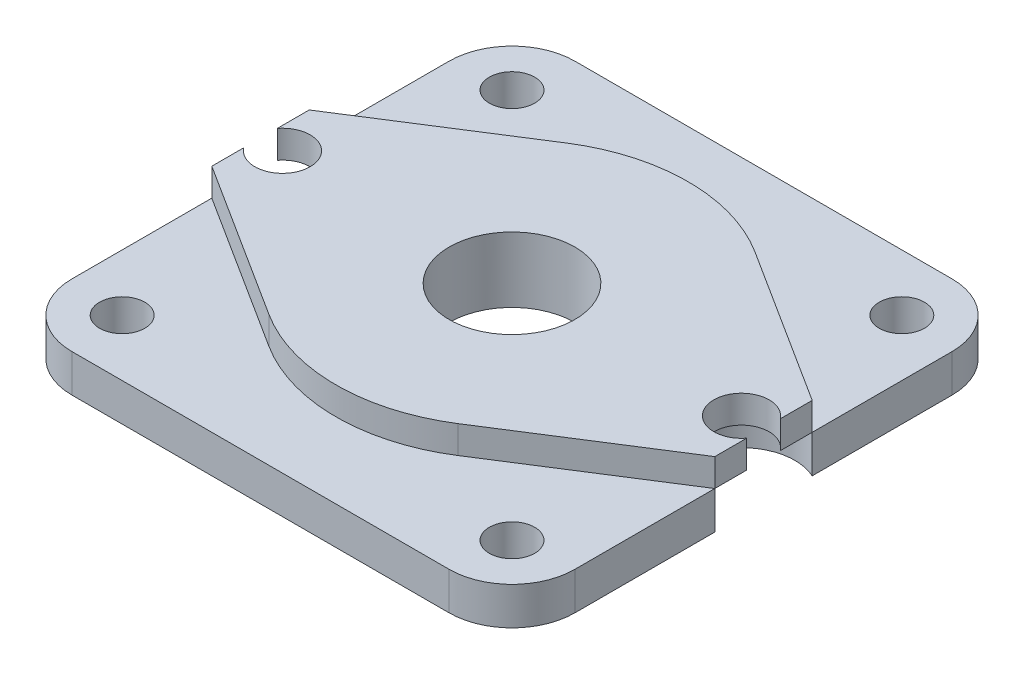
ISO-10303-21;
HEADER;
FILE_DESCRIPTION(('STEP AP214'),'2;1');
FILE_NAME('part.step','',(''),(''),'','','');
FILE_SCHEMA(('AUTOMOTIVE_DESIGN { 1 0 10303 214 1 1 1 1 }'));
ENDSEC;
DATA;
#1=APPLICATION_CONTEXT('core data for automotive mechanical design processes');
#2=APPLICATION_PROTOCOL_DEFINITION('international standard','automotive_design',2000,#1);
#3=PRODUCT_CONTEXT('',#1,'mechanical');
#4=PRODUCT('Part','Part','',(#3));
#5=PRODUCT_RELATED_PRODUCT_CATEGORY('part','',(#4));
#6=PRODUCT_DEFINITION_FORMATION('','',#4);
#7=PRODUCT_DEFINITION_CONTEXT('part definition',#1,'design');
#8=PRODUCT_DEFINITION('design','',#6,#7);
#9=PRODUCT_DEFINITION_SHAPE('','',#8);
#10=(LENGTH_UNIT() NAMED_UNIT(*) SI_UNIT(.MILLI.,.METRE.));
#11=(NAMED_UNIT(*) PLANE_ANGLE_UNIT() SI_UNIT($,.RADIAN.));
#12=(NAMED_UNIT(*) SI_UNIT($,.STERADIAN.) SOLID_ANGLE_UNIT());
#13=UNCERTAINTY_MEASURE_WITH_UNIT(LENGTH_MEASURE(1.E-05),#10,'distance_accuracy_value','');
#14=(GEOMETRIC_REPRESENTATION_CONTEXT(3) GLOBAL_UNCERTAINTY_ASSIGNED_CONTEXT((#13)) GLOBAL_UNIT_ASSIGNED_CONTEXT((#10,
#11,#12)) REPRESENTATION_CONTEXT('',''));
#15=CARTESIAN_POINT('',(0.,0.,0.));
#16=DIRECTION('',(0.,0.,1.));
#17=DIRECTION('',(1.,0.,0.));
#18=AXIS2_PLACEMENT_3D('',#15,#16,#17);
#19=CARTESIAN_POINT('',(-15.,3.,-15.));
#20=DIRECTION('',(0.,-1.,0.));
#21=DIRECTION('',(0.,0.,-1.));
#22=AXIS2_PLACEMENT_3D('',#19,#20,#21);
#23=PLANE('',#22);
#24=CARTESIAN_POINT('',(15.5,3.,15.5));
#25=DIRECTION('',(0.,1.,0.));
#26=DIRECTION('',(0.,0.,1.));
#27=AXIS2_PLACEMENT_3D('',#24,#25,#26);
#28=CIRCLE('',#27,1.79999999999999);
#29=CARTESIAN_POINT('',(15.5,3.,17.3));
#30=VERTEX_POINT('',#29);
#31=EDGE_CURVE('E217',#30,#30,#28,.T.);
#32=ORIENTED_EDGE('',*,*,#31,.F.);
#33=EDGE_LOOP('',(#32));
#34=FACE_BOUND('',#33,.T.);
#35=CARTESIAN_POINT('',(-15.5,3.,15.5));
#36=DIRECTION('',(0.,1.,0.));
#37=DIRECTION('',(0.,0.,1.));
#38=AXIS2_PLACEMENT_3D('',#35,#36,#37);
#39=CIRCLE('',#38,1.79999999999999);
#40=CARTESIAN_POINT('',(-15.5,3.,17.3));
#41=VERTEX_POINT('',#40);
#42=EDGE_CURVE('E223',#41,#41,#39,.T.);
#43=ORIENTED_EDGE('',*,*,#42,.F.);
#44=EDGE_LOOP('',(#43));
#45=FACE_BOUND('',#44,.T.);
#46=DIRECTION('',(0.843842743580431,0.,-0.536590555364751));
#47=VECTOR('',#46,1.);
#48=CARTESIAN_POINT('',(20.,3.,3.87298334620742));
#49=LINE('',#48,#47);
#50=CARTESIAN_POINT('',(7.51226777510651,3.,11.813798410126));
#51=VERTEX_POINT('',#50);
#52=CARTESIAN_POINT('',(20.,3.,3.87298334620742));
#53=VERTEX_POINT('',#52);
#54=EDGE_CURVE('E50',#51,#53,#49,.T.);
#55=ORIENTED_EDGE('',*,*,#54,.F.);
#56=CARTESIAN_POINT('',(0.,3.,0.));
#57=DIRECTION('',(0.,1.,0.));
#58=DIRECTION('',(0.,0.,1.));
#59=AXIS2_PLACEMENT_3D('',#56,#57,#58);
#60=CIRCLE('',#59,14.);
#61=CARTESIAN_POINT('',(-7.51226777510651,3.,11.813798410126));
#62=VERTEX_POINT('',#61);
#63=EDGE_CURVE('E54',#62,#51,#60,.T.);
#64=ORIENTED_EDGE('',*,*,#63,.F.);
#65=DIRECTION('',(0.843842743580431,0.,0.536590555364751));
#66=VECTOR('',#65,1.);
#67=CARTESIAN_POINT('',(-20.,3.,3.87298334620742));
#68=LINE('',#67,#66);
#69=CARTESIAN_POINT('',(-20.,3.,3.87298334620742));
#70=VERTEX_POINT('',#69);
#71=EDGE_CURVE('E347',#70,#62,#68,.T.);
#72=ORIENTED_EDGE('',*,*,#71,.F.);
#73=DIRECTION('',(0.,0.,1.));
#74=VECTOR('',#73,1.);
#75=CARTESIAN_POINT('',(-20.,3.,3.87298334620742));
#76=LINE('',#75,#74);
#77=CARTESIAN_POINT('',(-20.,3.,15.));
#78=VERTEX_POINT('',#77);
#79=EDGE_CURVE('E250',#70,#78,#76,.T.);
#80=ORIENTED_EDGE('',*,*,#79,.T.);
#81=CARTESIAN_POINT('',(-15.,3.,15.));
#82=DIRECTION('',(0.,1.,0.));
#83=DIRECTION('',(0.,0.,1.));
#84=AXIS2_PLACEMENT_3D('',#81,#82,#83);
#85=CIRCLE('',#84,5.);
#86=CARTESIAN_POINT('',(-15.,3.,20.));
#87=VERTEX_POINT('',#86);
#88=EDGE_CURVE('E252',#78,#87,#85,.T.);
#89=ORIENTED_EDGE('',*,*,#88,.T.);
#90=DIRECTION('',(1.,0.,0.));
#91=VECTOR('',#90,1.);
#92=CARTESIAN_POINT('',(-15.,3.,20.));
#93=LINE('',#92,#91);
#94=CARTESIAN_POINT('',(15.,3.,20.));
#95=VERTEX_POINT('',#94);
#96=EDGE_CURVE('E254',#87,#95,#93,.T.);
#97=ORIENTED_EDGE('',*,*,#96,.T.);
#98=CARTESIAN_POINT('',(15.,3.,15.));
#99=DIRECTION('',(0.,1.,0.));
#100=DIRECTION('',(0.,0.,1.));
#101=AXIS2_PLACEMENT_3D('',#98,#99,#100);
#102=CIRCLE('',#101,5.);
#103=CARTESIAN_POINT('',(20.,3.,15.));
#104=VERTEX_POINT('',#103);
#105=EDGE_CURVE('E256',#95,#104,#102,.T.);
#106=ORIENTED_EDGE('',*,*,#105,.T.);
#107=DIRECTION('',(0.,0.,-1.));
#108=VECTOR('',#107,1.);
#109=CARTESIAN_POINT('',(20.,3.,3.87298334620742));
#110=LINE('',#109,#108);
#111=EDGE_CURVE('E258',#104,#53,#110,.T.);
#112=ORIENTED_EDGE('',*,*,#111,.T.);
#113=EDGE_LOOP('',(#55,#64,#72,#80,#89,#97,#106,#112));
#114=FACE_BOUND('',#113,.T.);
#115=ADVANCED_FACE('F35',(#34,#45,#114),#23,.F.);
#116=CARTESIAN_POINT('',(15.5,3.,-15.5));
#117=DIRECTION('',(0.,1.,0.));
#118=DIRECTION('',(0.,0.,1.));
#119=AXIS2_PLACEMENT_3D('',#116,#117,#118);
#120=CIRCLE('',#119,1.8);
#121=CARTESIAN_POINT('',(15.5,3.,-13.7));
#122=VERTEX_POINT('',#121);
#123=EDGE_CURVE('E229',#122,#122,#120,.T.);
#124=ORIENTED_EDGE('',*,*,#123,.F.);
#125=EDGE_LOOP('',(#124));
#126=FACE_BOUND('',#125,.T.);
#127=CARTESIAN_POINT('',(-15.5,3.,-15.5));
#128=DIRECTION('',(0.,1.,0.));
#129=DIRECTION('',(0.,0.,1.));
#130=AXIS2_PLACEMENT_3D('',#127,#128,#129);
#131=CIRCLE('',#130,1.8);
#132=CARTESIAN_POINT('',(-15.5,3.,-13.7));
#133=VERTEX_POINT('',#132);
#134=EDGE_CURVE('E235',#133,#133,#131,.T.);
#135=ORIENTED_EDGE('',*,*,#134,.F.);
#136=EDGE_LOOP('',(#135));
#137=FACE_BOUND('',#136,.T.);
#138=DIRECTION('',(-0.843842743580431,0.,0.536590555364751));
#139=VECTOR('',#138,1.);
#140=CARTESIAN_POINT('',(-20.,3.,-3.87298334620742));
#141=LINE('',#140,#139);
#142=CARTESIAN_POINT('',(-7.51226777510651,3.,-11.813798410126));
#143=VERTEX_POINT('',#142);
#144=CARTESIAN_POINT('',(-20.,3.,-3.87298334620742));
#145=VERTEX_POINT('',#144);
#146=EDGE_CURVE('E405',#143,#145,#141,.T.);
#147=ORIENTED_EDGE('',*,*,#146,.F.);
#148=CARTESIAN_POINT('',(0.,3.,0.));
#149=DIRECTION('',(0.,1.,0.));
#150=DIRECTION('',(0.,0.,1.));
#151=AXIS2_PLACEMENT_3D('',#148,#149,#150);
#152=CIRCLE('',#151,14.);
#153=CARTESIAN_POINT('',(7.51226777510651,3.,-11.813798410126));
#154=VERTEX_POINT('',#153);
#155=EDGE_CURVE('E395',#154,#143,#152,.T.);
#156=ORIENTED_EDGE('',*,*,#155,.F.);
#157=DIRECTION('',(-0.843842743580431,0.,-0.536590555364751));
#158=VECTOR('',#157,1.);
#159=CARTESIAN_POINT('',(20.,3.,-3.87298334620742));
#160=LINE('',#159,#158);
#161=CARTESIAN_POINT('',(20.,3.,-3.87298334620742));
#162=VERTEX_POINT('',#161);
#163=EDGE_CURVE('E400',#162,#154,#160,.T.);
#164=ORIENTED_EDGE('',*,*,#163,.F.);
#165=DIRECTION('',(0.,0.,-1.));
#166=VECTOR('',#165,1.);
#167=CARTESIAN_POINT('',(20.,3.,-15.));
#168=LINE('',#167,#166);
#169=CARTESIAN_POINT('',(20.,3.,-15.));
#170=VERTEX_POINT('',#169);
#171=EDGE_CURVE('E263',#162,#170,#168,.T.);
#172=ORIENTED_EDGE('',*,*,#171,.T.);
#173=CARTESIAN_POINT('',(15.,3.,-15.));
#174=DIRECTION('',(0.,1.,0.));
#175=DIRECTION('',(0.,0.,1.));
#176=AXIS2_PLACEMENT_3D('',#173,#174,#175);
#177=CIRCLE('',#176,5.);
#178=CARTESIAN_POINT('',(15.,3.,-20.));
#179=VERTEX_POINT('',#178);
#180=EDGE_CURVE('E265',#170,#179,#177,.T.);
#181=ORIENTED_EDGE('',*,*,#180,.T.);
#182=DIRECTION('',(-1.,0.,0.));
#183=VECTOR('',#182,1.);
#184=CARTESIAN_POINT('',(-15.,3.,-20.));
#185=LINE('',#184,#183);
#186=CARTESIAN_POINT('',(-15.,3.,-20.));
#187=VERTEX_POINT('',#186);
#188=EDGE_CURVE('E267',#179,#187,#185,.T.);
#189=ORIENTED_EDGE('',*,*,#188,.T.);
#190=CARTESIAN_POINT('',(-15.,3.,-15.));
#191=DIRECTION('',(0.,1.,0.));
#192=DIRECTION('',(0.,0.,-1.));
#193=AXIS2_PLACEMENT_3D('',#190,#191,#192);
#194=CIRCLE('',#193,5.);
#195=CARTESIAN_POINT('',(-20.,3.,-15.));
#196=VERTEX_POINT('',#195);
#197=EDGE_CURVE('E241',#187,#196,#194,.T.);
#198=ORIENTED_EDGE('',*,*,#197,.T.);
#199=DIRECTION('',(0.,0.,1.));
#200=VECTOR('',#199,1.);
#201=CARTESIAN_POINT('',(-20.,3.,-15.));
#202=LINE('',#201,#200);
#203=EDGE_CURVE('E244',#196,#145,#202,.T.);
#204=ORIENTED_EDGE('',*,*,#203,.T.);
#205=EDGE_LOOP('',(#147,#156,#164,#172,#181,#189,#198,#204));
#206=FACE_BOUND('',#205,.T.);
#207=ADVANCED_FACE('F462',(#126,#137,#206),#23,.F.);
#208=CARTESIAN_POINT('',(-15.,0.,-15.));
#209=DIRECTION('',(0.,-1.,0.));
#210=DIRECTION('',(0.,0.,-1.));
#211=AXIS2_PLACEMENT_3D('',#208,#209,#210);
#212=PLANE('',#211);
#213=CARTESIAN_POINT('',(15.5,0.,15.5));
#214=DIRECTION('',(0.,1.,0.));
#215=DIRECTION('',(0.,0.,1.));
#216=AXIS2_PLACEMENT_3D('',#213,#214,#215);
#217=CIRCLE('',#216,1.79999999999999);
#218=CARTESIAN_POINT('',(15.5,0.,17.3));
#219=VERTEX_POINT('',#218);
#220=EDGE_CURVE('E211',#219,#219,#217,.T.);
#221=ORIENTED_EDGE('',*,*,#220,.T.);
#222=EDGE_LOOP('',(#221));
#223=FACE_BOUND('',#222,.T.);
#224=CARTESIAN_POINT('',(15.5,0.,-15.5));
#225=DIRECTION('',(0.,1.,0.));
#226=DIRECTION('',(0.,0.,1.));
#227=AXIS2_PLACEMENT_3D('',#224,#225,#226);
#228=CIRCLE('',#227,1.8);
#229=CARTESIAN_POINT('',(15.5,0.,-13.7));
#230=VERTEX_POINT('',#229);
#231=EDGE_CURVE('E226',#230,#230,#228,.T.);
#232=ORIENTED_EDGE('',*,*,#231,.T.);
#233=EDGE_LOOP('',(#232));
#234=FACE_BOUND('',#233,.T.);
#235=CARTESIAN_POINT('',(-15.,0.,-15.));
#236=DIRECTION('',(0.,1.,0.));
#237=DIRECTION('',(0.,0.,-1.));
#238=AXIS2_PLACEMENT_3D('',#235,#236,#237);
#239=CIRCLE('',#238,5.);
#240=CARTESIAN_POINT('',(-15.,0.,-20.));
#241=VERTEX_POINT('',#240);
#242=CARTESIAN_POINT('',(-20.,0.,-15.));
#243=VERTEX_POINT('',#242);
#244=EDGE_CURVE('E238',#241,#243,#239,.T.);
#245=ORIENTED_EDGE('',*,*,#244,.F.);
#246=DIRECTION('',(-1.,0.,0.));
#247=VECTOR('',#246,1.);
#248=CARTESIAN_POINT('',(-15.,0.,-20.));
#249=LINE('',#248,#247);
#250=CARTESIAN_POINT('',(15.,0.,-20.));
#251=VERTEX_POINT('',#250);
#252=EDGE_CURVE('E245',#251,#241,#249,.T.);
#253=ORIENTED_EDGE('',*,*,#252,.F.);
#254=CARTESIAN_POINT('',(15.,0.,-15.));
#255=DIRECTION('',(0.,1.,0.));
#256=DIRECTION('',(0.,0.,1.));
#257=AXIS2_PLACEMENT_3D('',#254,#255,#256);
#258=CIRCLE('',#257,5.);
#259=CARTESIAN_POINT('',(20.,0.,-15.));
#260=VERTEX_POINT('',#259);
#261=EDGE_CURVE('E290',#260,#251,#258,.T.);
#262=ORIENTED_EDGE('',*,*,#261,.F.);
#263=DIRECTION('',(0.,0.,-1.));
#264=VECTOR('',#263,1.);
#265=CARTESIAN_POINT('',(20.,0.,-15.));
#266=LINE('',#265,#264);
#267=CARTESIAN_POINT('',(20.,0.,-3.87298334620742));
#268=VERTEX_POINT('',#267);
#269=EDGE_CURVE('E288',#268,#260,#266,.T.);
#270=ORIENTED_EDGE('',*,*,#269,.F.);
#271=CARTESIAN_POINT('',(18.25,0.,0.));
#272=DIRECTION('',(0.,-1.,0.));
#273=DIRECTION('',(0.,0.,1.));
#274=AXIS2_PLACEMENT_3D('',#271,#272,#273);
#275=CIRCLE('',#274,4.25);
#276=CARTESIAN_POINT('',(20.,0.,3.87298334620742));
#277=VERTEX_POINT('',#276);
#278=EDGE_CURVE('E286',#277,#268,#275,.T.);
#279=ORIENTED_EDGE('',*,*,#278,.F.);
#280=DIRECTION('',(0.,0.,-1.));
#281=VECTOR('',#280,1.);
#282=CARTESIAN_POINT('',(20.,0.,3.87298334620742));
#283=LINE('',#282,#281);
#284=CARTESIAN_POINT('',(20.,0.,15.));
#285=VERTEX_POINT('',#284);
#286=EDGE_CURVE('E284',#285,#277,#283,.T.);
#287=ORIENTED_EDGE('',*,*,#286,.F.);
#288=CARTESIAN_POINT('',(15.,0.,15.));
#289=DIRECTION('',(0.,1.,0.));
#290=DIRECTION('',(0.,0.,1.));
#291=AXIS2_PLACEMENT_3D('',#288,#289,#290);
#292=CIRCLE('',#291,5.);
#293=CARTESIAN_POINT('',(15.,0.,20.));
#294=VERTEX_POINT('',#293);
#295=EDGE_CURVE('E282',#294,#285,#292,.T.);
#296=ORIENTED_EDGE('',*,*,#295,.F.);
#297=DIRECTION('',(1.,0.,0.));
#298=VECTOR('',#297,1.);
#299=CARTESIAN_POINT('',(-15.,0.,20.));
#300=LINE('',#299,#298);
#301=CARTESIAN_POINT('',(-15.,0.,20.));
#302=VERTEX_POINT('',#301);
#303=EDGE_CURVE('E280',#302,#294,#300,.T.);
#304=ORIENTED_EDGE('',*,*,#303,.F.);
#305=CARTESIAN_POINT('',(-15.,0.,15.));
#306=DIRECTION('',(0.,1.,0.));
#307=DIRECTION('',(0.,0.,1.));
#308=AXIS2_PLACEMENT_3D('',#305,#306,#307);
#309=CIRCLE('',#308,5.);
#310=CARTESIAN_POINT('',(-20.,0.,15.));
#311=VERTEX_POINT('',#310);
#312=EDGE_CURVE('E278',#311,#302,#309,.T.);
#313=ORIENTED_EDGE('',*,*,#312,.F.);
#314=DIRECTION('',(0.,0.,1.));
#315=VECTOR('',#314,1.);
#316=CARTESIAN_POINT('',(-20.,0.,3.87298334620742));
#317=LINE('',#316,#315);
#318=CARTESIAN_POINT('',(-20.,0.,3.87298334620742));
#319=VERTEX_POINT('',#318);
#320=EDGE_CURVE('E276',#319,#311,#317,.T.);
#321=ORIENTED_EDGE('',*,*,#320,.F.);
#322=CARTESIAN_POINT('',(-18.25,0.,0.));
#323=DIRECTION('',(0.,-1.,0.));
#324=DIRECTION('',(0.,0.,1.));
#325=AXIS2_PLACEMENT_3D('',#322,#323,#324);
#326=CIRCLE('',#325,4.25);
#327=CARTESIAN_POINT('',(-20.,0.,-3.87298334620742));
#328=VERTEX_POINT('',#327);
#329=EDGE_CURVE('E274',#328,#319,#326,.T.);
#330=ORIENTED_EDGE('',*,*,#329,.F.);
#331=DIRECTION('',(0.,0.,1.));
#332=VECTOR('',#331,1.);
#333=CARTESIAN_POINT('',(-20.,0.,-15.));
#334=LINE('',#333,#332);
#335=EDGE_CURVE('E272',#243,#328,#334,.T.);
#336=ORIENTED_EDGE('',*,*,#335,.F.);
#337=EDGE_LOOP('',(#245,#253,#262,#270,#279,#287,#296,#304,#313,#321,#330,#336));
#338=FACE_BOUND('',#337,.T.);
#339=CARTESIAN_POINT('',(-15.5,0.,-15.5));
#340=DIRECTION('',(0.,1.,0.));
#341=DIRECTION('',(0.,0.,1.));
#342=AXIS2_PLACEMENT_3D('',#339,#340,#341);
#343=CIRCLE('',#342,1.8);
#344=CARTESIAN_POINT('',(-15.5,0.,-13.7));
#345=VERTEX_POINT('',#344);
#346=EDGE_CURVE('E232',#345,#345,#343,.T.);
#347=ORIENTED_EDGE('',*,*,#346,.T.);
#348=EDGE_LOOP('',(#347));
#349=FACE_BOUND('',#348,.T.);
#350=CARTESIAN_POINT('',(-15.5,0.,15.5));
#351=DIRECTION('',(0.,1.,0.));
#352=DIRECTION('',(0.,0.,1.));
#353=AXIS2_PLACEMENT_3D('',#350,#351,#352);
#354=CIRCLE('',#353,1.79999999999999);
#355=CARTESIAN_POINT('',(-15.5,0.,17.3));
#356=VERTEX_POINT('',#355);
#357=EDGE_CURVE('E220',#356,#356,#354,.T.);
#358=ORIENTED_EDGE('',*,*,#357,.T.);
#359=EDGE_LOOP('',(#358));
#360=FACE_BOUND('',#359,.T.);
#361=CARTESIAN_POINT('',(0.,0.,0.));
#362=DIRECTION('',(0.,1.,0.));
#363=DIRECTION('',(0.,0.,1.));
#364=AXIS2_PLACEMENT_3D('',#361,#362,#363);
#365=CIRCLE('',#364,5.);
#366=CARTESIAN_POINT('',(0.,0.,5.));
#367=VERTEX_POINT('',#366);
#368=EDGE_CURVE('E208',#367,#367,#365,.T.);
#369=ORIENTED_EDGE('',*,*,#368,.T.);
#370=EDGE_LOOP('',(#369));
#371=FACE_BOUND('',#370,.T.);
#372=ADVANCED_FACE('F333',(#223,#234,#338,#349,#360,#371),#212,.T.);
#373=CARTESIAN_POINT('',(-15.,3.,-15.));
#374=DIRECTION('',(0.,-1.,0.));
#375=DIRECTION('',(0.,0.,-1.));
#376=AXIS2_PLACEMENT_3D('',#373,#374,#375);
#377=CYLINDRICAL_SURFACE('',#376,5.);
#378=ORIENTED_EDGE('',*,*,#244,.T.);
#379=DIRECTION('',(0.,-1.,0.));
#380=VECTOR('',#379,1.);
#381=CARTESIAN_POINT('',(-20.,3.,-15.));
#382=LINE('',#381,#380);
#383=EDGE_CURVE('E11',#196,#243,#382,.T.);
#384=ORIENTED_EDGE('',*,*,#383,.F.);
#385=ORIENTED_EDGE('',*,*,#197,.F.);
#386=DIRECTION('',(0.,-1.,0.));
#387=VECTOR('',#386,1.);
#388=CARTESIAN_POINT('',(-15.,3.,-20.));
#389=LINE('',#388,#387);
#390=EDGE_CURVE('E269',#187,#241,#389,.T.);
#391=ORIENTED_EDGE('',*,*,#390,.T.);
#392=EDGE_LOOP('',(#378,#384,#385,#391));
#393=FACE_BOUND('',#392,.T.);
#394=ADVANCED_FACE('F37',(#393),#377,.T.);
#395=CARTESIAN_POINT('',(-20.,3.,-15.));
#396=DIRECTION('',(1.,0.,0.));
#397=DIRECTION('',(0.,0.,-1.));
#398=AXIS2_PLACEMENT_3D('',#395,#396,#397);
#399=PLANE('',#398);
#400=ORIENTED_EDGE('',*,*,#335,.T.);
#401=DIRECTION('',(0.,-1.,0.));
#402=VECTOR('',#401,1.);
#403=CARTESIAN_POINT('',(-20.,3.,-3.87298334620742));
#404=LINE('',#403,#402);
#405=EDGE_CURVE('E43',#145,#328,#404,.T.);
#406=ORIENTED_EDGE('',*,*,#405,.F.);
#407=ORIENTED_EDGE('',*,*,#203,.F.);
#408=ORIENTED_EDGE('',*,*,#383,.T.);
#409=EDGE_LOOP('',(#400,#406,#407,#408));
#410=FACE_BOUND('',#409,.T.);
#411=ADVANCED_FACE('F465',(#410),#399,.F.);
#412=CARTESIAN_POINT('',(-18.25,3.,0.));
#413=DIRECTION('',(0.,-1.,0.));
#414=DIRECTION('',(0.,0.,-1.));
#415=AXIS2_PLACEMENT_3D('',#412,#413,#414);
#416=CYLINDRICAL_SURFACE('',#415,4.25);
#417=ORIENTED_EDGE('',*,*,#329,.T.);
#418=DIRECTION('',(0.,-1.,0.));
#419=VECTOR('',#418,1.);
#420=CARTESIAN_POINT('',(-20.,3.,3.87298334620742));
#421=LINE('',#420,#419);
#422=EDGE_CURVE('E319',#70,#319,#421,.T.);
#423=ORIENTED_EDGE('',*,*,#422,.F.);
#424=CARTESIAN_POINT('',(-18.25,3.,0.));
#425=DIRECTION('',(0.,-1.,0.));
#426=DIRECTION('',(0.,0.,1.));
#427=AXIS2_PLACEMENT_3D('',#424,#425,#426);
#428=CIRCLE('',#427,4.25);
#429=EDGE_CURVE('E247',#145,#70,#428,.T.);
#430=ORIENTED_EDGE('',*,*,#429,.F.);
#431=ORIENTED_EDGE('',*,*,#405,.T.);
#432=EDGE_LOOP('',(#417,#423,#430,#431));
#433=FACE_BOUND('',#432,.T.);
#434=ADVANCED_FACE('F326',(#433),#416,.F.);
#435=CARTESIAN_POINT('',(-20.,3.,3.87298334620742));
#436=DIRECTION('',(1.,0.,0.));
#437=DIRECTION('',(0.,0.,-1.));
#438=AXIS2_PLACEMENT_3D('',#435,#436,#437);
#439=PLANE('',#438);
#440=ORIENTED_EDGE('',*,*,#320,.T.);
#441=DIRECTION('',(0.,-1.,0.));
#442=VECTOR('',#441,1.);
#443=CARTESIAN_POINT('',(-20.,3.,15.));
#444=LINE('',#443,#442);
#445=EDGE_CURVE('E316',#78,#311,#444,.T.);
#446=ORIENTED_EDGE('',*,*,#445,.F.);
#447=ORIENTED_EDGE('',*,*,#79,.F.);
#448=ORIENTED_EDGE('',*,*,#422,.T.);
#449=EDGE_LOOP('',(#440,#446,#447,#448));
#450=FACE_BOUND('',#449,.T.);
#451=ADVANCED_FACE('F339',(#450),#439,.F.);
#452=CARTESIAN_POINT('',(-15.,3.,15.));
#453=DIRECTION('',(0.,-1.,0.));
#454=DIRECTION('',(0.,0.,-1.));
#455=AXIS2_PLACEMENT_3D('',#452,#453,#454);
#456=CYLINDRICAL_SURFACE('',#455,5.);
#457=ORIENTED_EDGE('',*,*,#312,.T.);
#458=DIRECTION('',(0.,-1.,0.));
#459=VECTOR('',#458,1.);
#460=CARTESIAN_POINT('',(-15.,3.,20.));
#461=LINE('',#460,#459);
#462=EDGE_CURVE('E313',#87,#302,#461,.T.);
#463=ORIENTED_EDGE('',*,*,#462,.F.);
#464=ORIENTED_EDGE('',*,*,#88,.F.);
#465=ORIENTED_EDGE('',*,*,#445,.T.);
#466=EDGE_LOOP('',(#457,#463,#464,#465));
#467=FACE_BOUND('',#466,.T.);
#468=ADVANCED_FACE('F343',(#467),#456,.T.);
#469=CARTESIAN_POINT('',(-15.,3.,20.));
#470=DIRECTION('',(0.,0.,-1.));
#471=DIRECTION('',(-1.,0.,0.));
#472=AXIS2_PLACEMENT_3D('',#469,#470,#471);
#473=PLANE('',#472);
#474=ORIENTED_EDGE('',*,*,#303,.T.);
#475=DIRECTION('',(0.,-1.,0.));
#476=VECTOR('',#475,1.);
#477=CARTESIAN_POINT('',(15.,3.,20.));
#478=LINE('',#477,#476);
#479=EDGE_CURVE('E310',#95,#294,#478,.T.);
#480=ORIENTED_EDGE('',*,*,#479,.F.);
#481=ORIENTED_EDGE('',*,*,#96,.F.);
#482=ORIENTED_EDGE('',*,*,#462,.T.);
#483=EDGE_LOOP('',(#474,#480,#481,#482));
#484=FACE_BOUND('',#483,.T.);
#485=ADVANCED_FACE('F497',(#484),#473,.F.);
#486=CARTESIAN_POINT('',(15.,3.,15.));
#487=DIRECTION('',(0.,-1.,0.));
#488=DIRECTION('',(0.,0.,-1.));
#489=AXIS2_PLACEMENT_3D('',#486,#487,#488);
#490=CYLINDRICAL_SURFACE('',#489,5.);
#491=ORIENTED_EDGE('',*,*,#295,.T.);
#492=DIRECTION('',(0.,-1.,0.));
#493=VECTOR('',#492,1.);
#494=CARTESIAN_POINT('',(20.,3.,15.));
#495=LINE('',#494,#493);
#496=EDGE_CURVE('E307',#104,#285,#495,.T.);
#497=ORIENTED_EDGE('',*,*,#496,.F.);
#498=ORIENTED_EDGE('',*,*,#105,.F.);
#499=ORIENTED_EDGE('',*,*,#479,.T.);
#500=EDGE_LOOP('',(#491,#497,#498,#499));
#501=FACE_BOUND('',#500,.T.);
#502=ADVANCED_FACE('F495',(#501),#490,.T.);
#503=CARTESIAN_POINT('',(20.,3.,3.87298334620742));
#504=DIRECTION('',(-1.,0.,0.));
#505=DIRECTION('',(0.,0.,1.));
#506=AXIS2_PLACEMENT_3D('',#503,#504,#505);
#507=PLANE('',#506);
#508=ORIENTED_EDGE('',*,*,#286,.T.);
#509=DIRECTION('',(0.,-1.,0.));
#510=VECTOR('',#509,1.);
#511=CARTESIAN_POINT('',(20.,3.,3.87298334620742));
#512=LINE('',#511,#510);
#513=EDGE_CURVE('E304',#53,#277,#512,.T.);
#514=ORIENTED_EDGE('',*,*,#513,.F.);
#515=ORIENTED_EDGE('',*,*,#111,.F.);
#516=ORIENTED_EDGE('',*,*,#496,.T.);
#517=EDGE_LOOP('',(#508,#514,#515,#516));
#518=FACE_BOUND('',#517,.T.);
#519=ADVANCED_FACE('F491',(#518),#507,.F.);
#520=CARTESIAN_POINT('',(18.25,3.,0.));
#521=DIRECTION('',(0.,-1.,0.));
#522=DIRECTION('',(0.,0.,-1.));
#523=AXIS2_PLACEMENT_3D('',#520,#521,#522);
#524=CYLINDRICAL_SURFACE('',#523,4.25);
#525=ORIENTED_EDGE('',*,*,#278,.T.);
#526=DIRECTION('',(0.,-1.,0.));
#527=VECTOR('',#526,1.);
#528=CARTESIAN_POINT('',(20.,3.,-3.87298334620742));
#529=LINE('',#528,#527);
#530=EDGE_CURVE('E301',#162,#268,#529,.T.);
#531=ORIENTED_EDGE('',*,*,#530,.F.);
#532=CARTESIAN_POINT('',(18.25,3.,0.));
#533=DIRECTION('',(0.,-1.,0.));
#534=DIRECTION('',(0.,0.,1.));
#535=AXIS2_PLACEMENT_3D('',#532,#533,#534);
#536=CIRCLE('',#535,4.25);
#537=EDGE_CURVE('E260',#53,#162,#536,.T.);
#538=ORIENTED_EDGE('',*,*,#537,.F.);
#539=ORIENTED_EDGE('',*,*,#513,.T.);
#540=EDGE_LOOP('',(#525,#531,#538,#539));
#541=FACE_BOUND('',#540,.T.);
#542=ADVANCED_FACE('F486',(#541),#524,.F.);
#543=CARTESIAN_POINT('',(20.,3.,-15.));
#544=DIRECTION('',(-1.,0.,0.));
#545=DIRECTION('',(0.,0.,1.));
#546=AXIS2_PLACEMENT_3D('',#543,#544,#545);
#547=PLANE('',#546);
#548=ORIENTED_EDGE('',*,*,#269,.T.);
#549=DIRECTION('',(0.,-1.,0.));
#550=VECTOR('',#549,1.);
#551=CARTESIAN_POINT('',(20.,3.,-15.));
#552=LINE('',#551,#550);
#553=EDGE_CURVE('E298',#170,#260,#552,.T.);
#554=ORIENTED_EDGE('',*,*,#553,.F.);
#555=ORIENTED_EDGE('',*,*,#171,.F.);
#556=ORIENTED_EDGE('',*,*,#530,.T.);
#557=EDGE_LOOP('',(#548,#554,#555,#556));
#558=FACE_BOUND('',#557,.T.);
#559=ADVANCED_FACE('F481',(#558),#547,.F.);
#560=CARTESIAN_POINT('',(15.,3.,-15.));
#561=DIRECTION('',(0.,-1.,0.));
#562=DIRECTION('',(0.,0.,-1.));
#563=AXIS2_PLACEMENT_3D('',#560,#561,#562);
#564=CYLINDRICAL_SURFACE('',#563,5.);
#565=ORIENTED_EDGE('',*,*,#261,.T.);
#566=DIRECTION('',(0.,-1.,0.));
#567=VECTOR('',#566,1.);
#568=CARTESIAN_POINT('',(15.,3.,-20.));
#569=LINE('',#568,#567);
#570=EDGE_CURVE('E295',#179,#251,#569,.T.);
#571=ORIENTED_EDGE('',*,*,#570,.F.);
#572=ORIENTED_EDGE('',*,*,#180,.F.);
#573=ORIENTED_EDGE('',*,*,#553,.T.);
#574=EDGE_LOOP('',(#565,#571,#572,#573));
#575=FACE_BOUND('',#574,.T.);
#576=ADVANCED_FACE('F477',(#575),#564,.T.);
#577=CARTESIAN_POINT('',(-15.,3.,-20.));
#578=DIRECTION('',(0.,0.,1.));
#579=DIRECTION('',(1.,0.,0.));
#580=AXIS2_PLACEMENT_3D('',#577,#578,#579);
#581=PLANE('',#580);
#582=ORIENTED_EDGE('',*,*,#252,.T.);
#583=ORIENTED_EDGE('',*,*,#390,.F.);
#584=ORIENTED_EDGE('',*,*,#188,.F.);
#585=ORIENTED_EDGE('',*,*,#570,.T.);
#586=EDGE_LOOP('',(#582,#583,#584,#585));
#587=FACE_BOUND('',#586,.T.);
#588=ADVANCED_FACE('F472',(#587),#581,.F.);
#589=CARTESIAN_POINT('',(-15.5,3.,-15.5));
#590=DIRECTION('',(0.,-1.,0.));
#591=DIRECTION('',(0.,0.,-1.));
#592=AXIS2_PLACEMENT_3D('',#589,#590,#591);
#593=CYLINDRICAL_SURFACE('',#592,1.8);
#594=ORIENTED_EDGE('',*,*,#134,.T.);
#595=EDGE_LOOP('',(#594));
#596=FACE_BOUND('',#595,.T.);
#597=ORIENTED_EDGE('',*,*,#346,.F.);
#598=EDGE_LOOP('',(#597));
#599=FACE_BOUND('',#598,.T.);
#600=ADVANCED_FACE('F517',(#596,#599),#593,.F.);
#601=CARTESIAN_POINT('',(15.5,3.,-15.5));
#602=DIRECTION('',(0.,-1.,0.));
#603=DIRECTION('',(0.,0.,-1.));
#604=AXIS2_PLACEMENT_3D('',#601,#602,#603);
#605=CYLINDRICAL_SURFACE('',#604,1.8);
#606=ORIENTED_EDGE('',*,*,#123,.T.);
#607=EDGE_LOOP('',(#606));
#608=FACE_BOUND('',#607,.T.);
#609=ORIENTED_EDGE('',*,*,#231,.F.);
#610=EDGE_LOOP('',(#609));
#611=FACE_BOUND('',#610,.T.);
#612=ADVANCED_FACE('F559',(#608,#611),#605,.F.);
#613=CARTESIAN_POINT('',(-15.5,3.,15.5));
#614=DIRECTION('',(0.,-1.,0.));
#615=DIRECTION('',(0.,0.,-1.));
#616=AXIS2_PLACEMENT_3D('',#613,#614,#615);
#617=CYLINDRICAL_SURFACE('',#616,1.79999999999999);
#618=ORIENTED_EDGE('',*,*,#42,.T.);
#619=EDGE_LOOP('',(#618));
#620=FACE_BOUND('',#619,.T.);
#621=ORIENTED_EDGE('',*,*,#357,.F.);
#622=EDGE_LOOP('',(#621));
#623=FACE_BOUND('',#622,.T.);
#624=ADVANCED_FACE('F566',(#620,#623),#617,.F.);
#625=CARTESIAN_POINT('',(15.5,3.,15.5));
#626=DIRECTION('',(0.,-1.,0.));
#627=DIRECTION('',(0.,0.,-1.));
#628=AXIS2_PLACEMENT_3D('',#625,#626,#627);
#629=CYLINDRICAL_SURFACE('',#628,1.79999999999999);
#630=ORIENTED_EDGE('',*,*,#31,.T.);
#631=EDGE_LOOP('',(#630));
#632=FACE_BOUND('',#631,.T.);
#633=ORIENTED_EDGE('',*,*,#220,.F.);
#634=EDGE_LOOP('',(#633));
#635=FACE_BOUND('',#634,.T.);
#636=ADVANCED_FACE('F573',(#632,#635),#629,.F.);
#637=CARTESIAN_POINT('',(0.,3.,0.));
#638=DIRECTION('',(0.,-1.,0.));
#639=DIRECTION('',(0.,0.,-1.));
#640=AXIS2_PLACEMENT_3D('',#637,#638,#639);
#641=CYLINDRICAL_SURFACE('',#640,5.);
#642=ORIENTED_EDGE('',*,*,#368,.F.);
#643=EDGE_LOOP('',(#642));
#644=FACE_BOUND('',#643,.T.);
#645=CARTESIAN_POINT('',(0.,5.2,0.));
#646=DIRECTION('',(0.,-1.,0.));
#647=DIRECTION('',(0.,0.,-1.));
#648=AXIS2_PLACEMENT_3D('',#645,#646,#647);
#649=CIRCLE('',#648,5.);
#650=CARTESIAN_POINT('',(0.,5.2,-5.));
#651=VERTEX_POINT('',#650);
#652=EDGE_CURVE('E438',#651,#651,#649,.T.);
#653=ORIENTED_EDGE('',*,*,#652,.F.);
#654=EDGE_LOOP('',(#653));
#655=FACE_BOUND('',#654,.T.);
#656=ADVANCED_FACE('F581',(#644,#655),#641,.F.);
#657=CARTESIAN_POINT('',(18.25,5.2,0.));
#658=DIRECTION('',(0.,1.,0.));
#659=DIRECTION('',(0.,0.,1.));
#660=AXIS2_PLACEMENT_3D('',#657,#658,#659);
#661=PLANE('',#660);
#662=ORIENTED_EDGE('',*,*,#652,.T.);
#663=EDGE_LOOP('',(#662));
#664=FACE_BOUND('',#663,.T.);
#665=CARTESIAN_POINT('',(18.25,5.2,0.));
#666=DIRECTION('',(0.,-1.,0.));
#667=DIRECTION('',(0.,0.,1.));
#668=AXIS2_PLACEMENT_3D('',#665,#666,#667);
#669=CIRCLE('',#668,2.2);
#670=CARTESIAN_POINT('',(20.,5.2,1.33322916259734));
#671=VERTEX_POINT('',#670);
#672=CARTESIAN_POINT('',(20.,5.2,-1.33322916259734));
#673=VERTEX_POINT('',#672);
#674=EDGE_CURVE('E194',#671,#673,#669,.T.);
#675=ORIENTED_EDGE('',*,*,#674,.T.);
#676=DIRECTION('',(0.,0.,-1.));
#677=VECTOR('',#676,1.);
#678=CARTESIAN_POINT('',(20.,5.2,-3.87298334620742));
#679=LINE('',#678,#677);
#680=CARTESIAN_POINT('',(20.,5.2,-3.87298334620742));
#681=VERTEX_POINT('',#680);
#682=EDGE_CURVE('E182',#673,#681,#679,.T.);
#683=ORIENTED_EDGE('',*,*,#682,.T.);
#684=DIRECTION('',(-0.843842743580431,0.,-0.536590555364751));
#685=VECTOR('',#684,1.);
#686=CARTESIAN_POINT('',(20.,5.2,-3.87298334620742));
#687=LINE('',#686,#685);
#688=CARTESIAN_POINT('',(7.51226777510651,5.2,-11.813798410126));
#689=VERTEX_POINT('',#688);
#690=EDGE_CURVE('E193',#681,#689,#687,.T.);
#691=ORIENTED_EDGE('',*,*,#690,.T.);
#692=CARTESIAN_POINT('',(0.,5.2,0.));
#693=DIRECTION('',(0.,1.,0.));
#694=DIRECTION('',(0.,0.,1.));
#695=AXIS2_PLACEMENT_3D('',#692,#693,#694);
#696=CIRCLE('',#695,14.);
#697=CARTESIAN_POINT('',(-7.51226777510651,5.2,-11.813798410126));
#698=VERTEX_POINT('',#697);
#699=EDGE_CURVE('E396',#689,#698,#696,.T.);
#700=ORIENTED_EDGE('',*,*,#699,.T.);
#701=DIRECTION('',(-0.843842743580431,0.,0.536590555364751));
#702=VECTOR('',#701,1.);
#703=CARTESIAN_POINT('',(-20.,5.2,-3.87298334620742));
#704=LINE('',#703,#702);
#705=CARTESIAN_POINT('',(-20.,5.2,-3.87298334620742));
#706=VERTEX_POINT('',#705);
#707=EDGE_CURVE('E446',#698,#706,#704,.T.);
#708=ORIENTED_EDGE('',*,*,#707,.T.);
#709=DIRECTION('',(0.,0.,1.));
#710=VECTOR('',#709,1.);
#711=CARTESIAN_POINT('',(-20.,5.2,-3.87298334620742));
#712=LINE('',#711,#710);
#713=CARTESIAN_POINT('',(-20.,5.2,-1.33322916259734));
#714=VERTEX_POINT('',#713);
#715=EDGE_CURVE('E448',#706,#714,#712,.T.);
#716=ORIENTED_EDGE('',*,*,#715,.T.);
#717=CARTESIAN_POINT('',(-18.25,5.2,0.));
#718=DIRECTION('',(0.,-1.,0.));
#719=DIRECTION('',(0.,0.,1.));
#720=AXIS2_PLACEMENT_3D('',#717,#718,#719);
#721=CIRCLE('',#720,2.2);
#722=CARTESIAN_POINT('',(-20.,5.2,1.33322916259734));
#723=VERTEX_POINT('',#722);
#724=EDGE_CURVE('E450',#714,#723,#721,.T.);
#725=ORIENTED_EDGE('',*,*,#724,.T.);
#726=DIRECTION('',(0.,0.,1.));
#727=VECTOR('',#726,1.);
#728=CARTESIAN_POINT('',(-20.,5.2,3.87298334620742));
#729=LINE('',#728,#727);
#730=CARTESIAN_POINT('',(-20.,5.2,3.87298334620742));
#731=VERTEX_POINT('',#730);
#732=EDGE_CURVE('E434',#723,#731,#729,.T.);
#733=ORIENTED_EDGE('',*,*,#732,.T.);
#734=DIRECTION('',(0.843842743580431,0.,0.536590555364751));
#735=VECTOR('',#734,1.);
#736=CARTESIAN_POINT('',(-20.,5.2,3.87298334620742));
#737=LINE('',#736,#735);
#738=CARTESIAN_POINT('',(-7.51226777510651,5.2,11.813798410126));
#739=VERTEX_POINT('',#738);
#740=EDGE_CURVE('E372',#731,#739,#737,.T.);
#741=ORIENTED_EDGE('',*,*,#740,.T.);
#742=CARTESIAN_POINT('',(0.,5.2,0.));
#743=DIRECTION('',(0.,1.,0.));
#744=DIRECTION('',(0.,0.,1.));
#745=AXIS2_PLACEMENT_3D('',#742,#743,#744);
#746=CIRCLE('',#745,14.);
#747=CARTESIAN_POINT('',(7.51226777510651,5.2,11.813798410126));
#748=VERTEX_POINT('',#747);
#749=EDGE_CURVE('E431',#739,#748,#746,.T.);
#750=ORIENTED_EDGE('',*,*,#749,.T.);
#751=DIRECTION('',(0.843842743580431,0.,-0.536590555364751));
#752=VECTOR('',#751,1.);
#753=CARTESIAN_POINT('',(20.,5.2,3.87298334620742));
#754=LINE('',#753,#752);
#755=CARTESIAN_POINT('',(20.,5.2,3.87298334620742));
#756=VERTEX_POINT('',#755);
#757=EDGE_CURVE('E427',#748,#756,#754,.T.);
#758=ORIENTED_EDGE('',*,*,#757,.T.);
#759=DIRECTION('',(0.,0.,-1.));
#760=VECTOR('',#759,1.);
#761=CARTESIAN_POINT('',(20.,5.2,1.33322916259734));
#762=LINE('',#761,#760);
#763=EDGE_CURVE('E199',#756,#671,#762,.T.);
#764=ORIENTED_EDGE('',*,*,#763,.T.);
#765=EDGE_LOOP('',(#675,#683,#691,#700,#708,#716,#725,#733,#741,#750,#758,#764));
#766=FACE_BOUND('',#765,.T.);
#767=ADVANCED_FACE('F197',(#664,#766),#661,.T.);
#768=CARTESIAN_POINT('',(20.,5.2,1.33322916259734));
#769=DIRECTION('',(-1.,0.,0.));
#770=DIRECTION('',(0.,0.,1.));
#771=AXIS2_PLACEMENT_3D('',#768,#769,#770);
#772=PLANE('',#771);
#773=DIRECTION('',(0.,0.,-1.));
#774=VECTOR('',#773,1.);
#775=CARTESIAN_POINT('',(20.,3.,1.33322916259734));
#776=LINE('',#775,#774);
#777=CARTESIAN_POINT('',(20.,3.,1.33322916259734));
#778=VERTEX_POINT('',#777);
#779=EDGE_CURVE('E203',#53,#778,#776,.T.);
#780=ORIENTED_EDGE('',*,*,#779,.T.);
#781=DIRECTION('',(0.,-1.,0.));
#782=VECTOR('',#781,1.);
#783=CARTESIAN_POINT('',(20.,5.2,1.33322916259734));
#784=LINE('',#783,#782);
#785=EDGE_CURVE('E417',#671,#778,#784,.T.);
#786=ORIENTED_EDGE('',*,*,#785,.F.);
#787=ORIENTED_EDGE('',*,*,#763,.F.);
#788=DIRECTION('',(0.,-1.,0.));
#789=VECTOR('',#788,1.);
#790=CARTESIAN_POINT('',(20.,5.2,3.87298334620742));
#791=LINE('',#790,#789);
#792=EDGE_CURVE('E419',#756,#53,#791,.T.);
#793=ORIENTED_EDGE('',*,*,#792,.T.);
#794=EDGE_LOOP('',(#780,#786,#787,#793));
#795=FACE_BOUND('',#794,.T.);
#796=ADVANCED_FACE('F597',(#795),#772,.F.);
#797=CARTESIAN_POINT('',(20.,5.2,3.87298334620742));
#798=DIRECTION('',(-0.536590555364751,0.,-0.843842743580431));
#799=DIRECTION('',(-0.843842743580431,0.,0.536590555364751));
#800=AXIS2_PLACEMENT_3D('',#797,#798,#799);
#801=PLANE('',#800);
#802=ORIENTED_EDGE('',*,*,#54,.T.);
#803=ORIENTED_EDGE('',*,*,#792,.F.);
#804=ORIENTED_EDGE('',*,*,#757,.F.);
#805=DIRECTION('',(0.,-1.,0.));
#806=VECTOR('',#805,1.);
#807=CARTESIAN_POINT('',(7.51226777510651,5.2,11.813798410126));
#808=LINE('',#807,#806);
#809=EDGE_CURVE('E377',#748,#51,#808,.T.);
#810=ORIENTED_EDGE('',*,*,#809,.T.);
#811=EDGE_LOOP('',(#802,#803,#804,#810));
#812=FACE_BOUND('',#811,.T.);
#813=ADVANCED_FACE('F425',(#812),#801,.F.);
#814=CARTESIAN_POINT('',(0.,5.2,0.));
#815=DIRECTION('',(0.,-1.,0.));
#816=DIRECTION('',(0.,0.,-1.));
#817=AXIS2_PLACEMENT_3D('',#814,#815,#816);
#818=CYLINDRICAL_SURFACE('',#817,14.);
#819=ORIENTED_EDGE('',*,*,#63,.T.);
#820=ORIENTED_EDGE('',*,*,#809,.F.);
#821=ORIENTED_EDGE('',*,*,#749,.F.);
#822=DIRECTION('',(0.,-1.,0.));
#823=VECTOR('',#822,1.);
#824=CARTESIAN_POINT('',(-7.51226777510651,5.2,11.813798410126));
#825=LINE('',#824,#823);
#826=EDGE_CURVE('E373',#739,#62,#825,.T.);
#827=ORIENTED_EDGE('',*,*,#826,.T.);
#828=EDGE_LOOP('',(#819,#820,#821,#827));
#829=FACE_BOUND('',#828,.T.);
#830=ADVANCED_FACE('F430',(#829),#818,.T.);
#831=CARTESIAN_POINT('',(-20.,5.2,3.87298334620742));
#832=DIRECTION('',(0.536590555364751,0.,-0.843842743580431));
#833=DIRECTION('',(-0.843842743580431,0.,-0.536590555364751));
#834=AXIS2_PLACEMENT_3D('',#831,#832,#833);
#835=PLANE('',#834);
#836=ORIENTED_EDGE('',*,*,#71,.T.);
#837=ORIENTED_EDGE('',*,*,#826,.F.);
#838=ORIENTED_EDGE('',*,*,#740,.F.);
#839=DIRECTION('',(0.,-1.,0.));
#840=VECTOR('',#839,1.);
#841=CARTESIAN_POINT('',(-20.,5.2,3.87298334620742));
#842=LINE('',#841,#840);
#843=EDGE_CURVE('E362',#731,#70,#842,.T.);
#844=ORIENTED_EDGE('',*,*,#843,.T.);
#845=EDGE_LOOP('',(#836,#837,#838,#844));
#846=FACE_BOUND('',#845,.T.);
#847=ADVANCED_FACE('F369',(#846),#835,.F.);
#848=CARTESIAN_POINT('',(-20.,5.2,3.87298334620742));
#849=DIRECTION('',(1.,0.,0.));
#850=DIRECTION('',(0.,0.,-1.));
#851=AXIS2_PLACEMENT_3D('',#848,#849,#850);
#852=PLANE('',#851);
#853=DIRECTION('',(0.,0.,1.));
#854=VECTOR('',#853,1.);
#855=CARTESIAN_POINT('',(-20.,3.,3.87298334620742));
#856=LINE('',#855,#854);
#857=CARTESIAN_POINT('',(-20.,3.,1.33322916259734));
#858=VERTEX_POINT('',#857);
#859=EDGE_CURVE('E354',#858,#70,#856,.T.);
#860=ORIENTED_EDGE('',*,*,#859,.T.);
#861=ORIENTED_EDGE('',*,*,#843,.F.);
#862=ORIENTED_EDGE('',*,*,#732,.F.);
#863=DIRECTION('',(0.,-1.,0.));
#864=VECTOR('',#863,1.);
#865=CARTESIAN_POINT('',(-20.,5.2,1.33322916259734));
#866=LINE('',#865,#864);
#867=EDGE_CURVE('E365',#723,#858,#866,.T.);
#868=ORIENTED_EDGE('',*,*,#867,.T.);
#869=EDGE_LOOP('',(#860,#861,#862,#868));
#870=FACE_BOUND('',#869,.T.);
#871=ADVANCED_FACE('F360',(#870),#852,.F.);
#872=CARTESIAN_POINT('',(-18.25,5.2,0.));
#873=DIRECTION('',(0.,-1.,0.));
#874=DIRECTION('',(0.,0.,-1.));
#875=AXIS2_PLACEMENT_3D('',#872,#873,#874);
#876=CYLINDRICAL_SURFACE('',#875,2.2);
#877=CARTESIAN_POINT('',(-18.25,3.,0.));
#878=DIRECTION('',(0.,-1.,0.));
#879=DIRECTION('',(0.,0.,1.));
#880=AXIS2_PLACEMENT_3D('',#877,#878,#879);
#881=CIRCLE('',#880,2.2);
#882=CARTESIAN_POINT('',(-20.,3.,-1.33322916259734));
#883=VERTEX_POINT('',#882);
#884=EDGE_CURVE('E366',#883,#858,#881,.T.);
#885=ORIENTED_EDGE('',*,*,#884,.T.);
#886=ORIENTED_EDGE('',*,*,#867,.F.);
#887=ORIENTED_EDGE('',*,*,#724,.F.);
#888=DIRECTION('',(0.,-1.,0.));
#889=VECTOR('',#888,1.);
#890=CARTESIAN_POINT('',(-20.,5.2,-1.33322916259734));
#891=LINE('',#890,#889);
#892=EDGE_CURVE('E375',#714,#883,#891,.T.);
#893=ORIENTED_EDGE('',*,*,#892,.T.);
#894=EDGE_LOOP('',(#885,#886,#887,#893));
#895=FACE_BOUND('',#894,.T.);
#896=ADVANCED_FACE('F455',(#895),#876,.F.);
#897=CARTESIAN_POINT('',(-20.,5.2,-3.87298334620742));
#898=DIRECTION('',(1.,0.,0.));
#899=DIRECTION('',(0.,0.,-1.));
#900=AXIS2_PLACEMENT_3D('',#897,#898,#899);
#901=PLANE('',#900);
#902=DIRECTION('',(0.,0.,1.));
#903=VECTOR('',#902,1.);
#904=CARTESIAN_POINT('',(-20.,3.,-3.87298334620742));
#905=LINE('',#904,#903);
#906=EDGE_CURVE('E355',#145,#883,#905,.T.);
#907=ORIENTED_EDGE('',*,*,#906,.T.);
#908=ORIENTED_EDGE('',*,*,#892,.F.);
#909=ORIENTED_EDGE('',*,*,#715,.F.);
#910=DIRECTION('',(0.,-1.,0.));
#911=VECTOR('',#910,1.);
#912=CARTESIAN_POINT('',(-20.,5.2,-3.87298334620742));
#913=LINE('',#912,#911);
#914=EDGE_CURVE('E383',#706,#145,#913,.T.);
#915=ORIENTED_EDGE('',*,*,#914,.T.);
#916=EDGE_LOOP('',(#907,#908,#909,#915));
#917=FACE_BOUND('',#916,.T.);
#918=ADVANCED_FACE('F457',(#917),#901,.F.);
#919=CARTESIAN_POINT('',(-20.,5.2,-3.87298334620742));
#920=DIRECTION('',(0.536590555364751,0.,0.843842743580431));
#921=DIRECTION('',(0.843842743580431,0.,-0.536590555364751));
#922=AXIS2_PLACEMENT_3D('',#919,#920,#921);
#923=PLANE('',#922);
#924=ORIENTED_EDGE('',*,*,#146,.T.);
#925=ORIENTED_EDGE('',*,*,#914,.F.);
#926=ORIENTED_EDGE('',*,*,#707,.F.);
#927=DIRECTION('',(0.,-1.,0.));
#928=VECTOR('',#927,1.);
#929=CARTESIAN_POINT('',(-7.51226777510651,5.2,-11.813798410126));
#930=LINE('',#929,#928);
#931=EDGE_CURVE('E386',#698,#143,#930,.T.);
#932=ORIENTED_EDGE('',*,*,#931,.T.);
#933=EDGE_LOOP('',(#924,#925,#926,#932));
#934=FACE_BOUND('',#933,.T.);
#935=ADVANCED_FACE('F461',(#934),#923,.F.);
#936=CARTESIAN_POINT('',(0.,5.2,0.));
#937=DIRECTION('',(0.,-1.,0.));
#938=DIRECTION('',(0.,0.,-1.));
#939=AXIS2_PLACEMENT_3D('',#936,#937,#938);
#940=CYLINDRICAL_SURFACE('',#939,14.);
#941=ORIENTED_EDGE('',*,*,#155,.T.);
#942=ORIENTED_EDGE('',*,*,#931,.F.);
#943=ORIENTED_EDGE('',*,*,#699,.F.);
#944=DIRECTION('',(0.,-1.,0.));
#945=VECTOR('',#944,1.);
#946=CARTESIAN_POINT('',(7.51226777510651,5.2,-11.813798410126));
#947=LINE('',#946,#945);
#948=EDGE_CURVE('E213',#689,#154,#947,.T.);
#949=ORIENTED_EDGE('',*,*,#948,.T.);
#950=EDGE_LOOP('',(#941,#942,#943,#949));
#951=FACE_BOUND('',#950,.T.);
#952=ADVANCED_FACE('F393',(#951),#940,.T.);
#953=CARTESIAN_POINT('',(20.,5.2,-3.87298334620742));
#954=DIRECTION('',(-0.536590555364751,0.,0.843842743580431));
#955=DIRECTION('',(0.843842743580431,0.,0.536590555364751));
#956=AXIS2_PLACEMENT_3D('',#953,#954,#955);
#957=PLANE('',#956);
#958=ORIENTED_EDGE('',*,*,#163,.T.);
#959=ORIENTED_EDGE('',*,*,#948,.F.);
#960=ORIENTED_EDGE('',*,*,#690,.F.);
#961=DIRECTION('',(0.,-1.,0.));
#962=VECTOR('',#961,1.);
#963=CARTESIAN_POINT('',(20.,5.2,-3.87298334620742));
#964=LINE('',#963,#962);
#965=EDGE_CURVE('E190',#681,#162,#964,.T.);
#966=ORIENTED_EDGE('',*,*,#965,.T.);
#967=EDGE_LOOP('',(#958,#959,#960,#966));
#968=FACE_BOUND('',#967,.T.);
#969=ADVANCED_FACE('F399',(#968),#957,.F.);
#970=CARTESIAN_POINT('',(20.,5.2,-3.87298334620742));
#971=DIRECTION('',(-1.,0.,0.));
#972=DIRECTION('',(0.,0.,1.));
#973=AXIS2_PLACEMENT_3D('',#970,#971,#972);
#974=PLANE('',#973);
#975=DIRECTION('',(0.,0.,-1.));
#976=VECTOR('',#975,1.);
#977=CARTESIAN_POINT('',(20.,3.,-3.87298334620742));
#978=LINE('',#977,#976);
#979=CARTESIAN_POINT('',(20.,3.,-1.33322916259734));
#980=VERTEX_POINT('',#979);
#981=EDGE_CURVE('E403',#980,#162,#978,.T.);
#982=ORIENTED_EDGE('',*,*,#981,.T.);
#983=ORIENTED_EDGE('',*,*,#965,.F.);
#984=ORIENTED_EDGE('',*,*,#682,.F.);
#985=DIRECTION('',(0.,-1.,0.));
#986=VECTOR('',#985,1.);
#987=CARTESIAN_POINT('',(20.,5.2,-1.33322916259734));
#988=LINE('',#987,#986);
#989=EDGE_CURVE('E187',#673,#980,#988,.T.);
#990=ORIENTED_EDGE('',*,*,#989,.T.);
#991=EDGE_LOOP('',(#982,#983,#984,#990));
#992=FACE_BOUND('',#991,.T.);
#993=ADVANCED_FACE('F185',(#992),#974,.F.);
#994=CARTESIAN_POINT('',(18.25,5.2,0.));
#995=DIRECTION('',(0.,-1.,0.));
#996=DIRECTION('',(0.,0.,-1.));
#997=AXIS2_PLACEMENT_3D('',#994,#995,#996);
#998=CYLINDRICAL_SURFACE('',#997,2.2);
#999=CARTESIAN_POINT('',(18.25,3.,0.));
#1000=DIRECTION('',(0.,-1.,0.));
#1001=DIRECTION('',(0.,0.,1.));
#1002=AXIS2_PLACEMENT_3D('',#999,#1000,#1001);
#1003=CIRCLE('',#1002,2.2);
#1004=EDGE_CURVE('E207',#778,#980,#1003,.T.);
#1005=ORIENTED_EDGE('',*,*,#1004,.T.);
#1006=ORIENTED_EDGE('',*,*,#989,.F.);
#1007=ORIENTED_EDGE('',*,*,#674,.F.);
#1008=ORIENTED_EDGE('',*,*,#785,.T.);
#1009=EDGE_LOOP('',(#1005,#1006,#1007,#1008));
#1010=FACE_BOUND('',#1009,.T.);
#1011=ADVANCED_FACE('F205',(#1010),#998,.F.);
#1012=CARTESIAN_POINT('',(18.25,3.,0.));
#1013=DIRECTION('',(0.,1.,0.));
#1014=DIRECTION('',(0.,0.,1.));
#1015=AXIS2_PLACEMENT_3D('',#1012,#1013,#1014);
#1016=PLANE('',#1015);
#1017=ORIENTED_EDGE('',*,*,#779,.F.);
#1018=ORIENTED_EDGE('',*,*,#537,.T.);
#1019=ORIENTED_EDGE('',*,*,#981,.F.);
#1020=ORIENTED_EDGE('',*,*,#1004,.F.);
#1021=EDGE_LOOP('',(#1017,#1018,#1019,#1020));
#1022=FACE_BOUND('',#1021,.T.);
#1023=ADVANCED_FACE('F670',(#1022),#1016,.F.);
#1024=ORIENTED_EDGE('',*,*,#906,.F.);
#1025=ORIENTED_EDGE('',*,*,#429,.T.);
#1026=ORIENTED_EDGE('',*,*,#859,.F.);
#1027=ORIENTED_EDGE('',*,*,#884,.F.);
#1028=EDGE_LOOP('',(#1024,#1025,#1026,#1027));
#1029=FACE_BOUND('',#1028,.T.);
#1030=ADVANCED_FACE('F352',(#1029),#1016,.F.);
#1031=CLOSED_SHELL('',(#115,#207,#372,#394,#411,#434,#451,#468,#485,#502,#519,#542,#559,#576,
#588,#600,#612,#624,#636,#656,#767,#796,#813,#830,#847,#871,#896,#918,#935,#952,#969,#993,#1011,
#1023,#1030));
#1032=MANIFOLD_SOLID_BREP('B2',#1031);
#1033=ADVANCED_BREP_SHAPE_REPRESENTATION('',(#18,#1032),#14);
#1034=SHAPE_DEFINITION_REPRESENTATION(#9,#1033);
ENDSEC;
END-ISO-10303-21;
